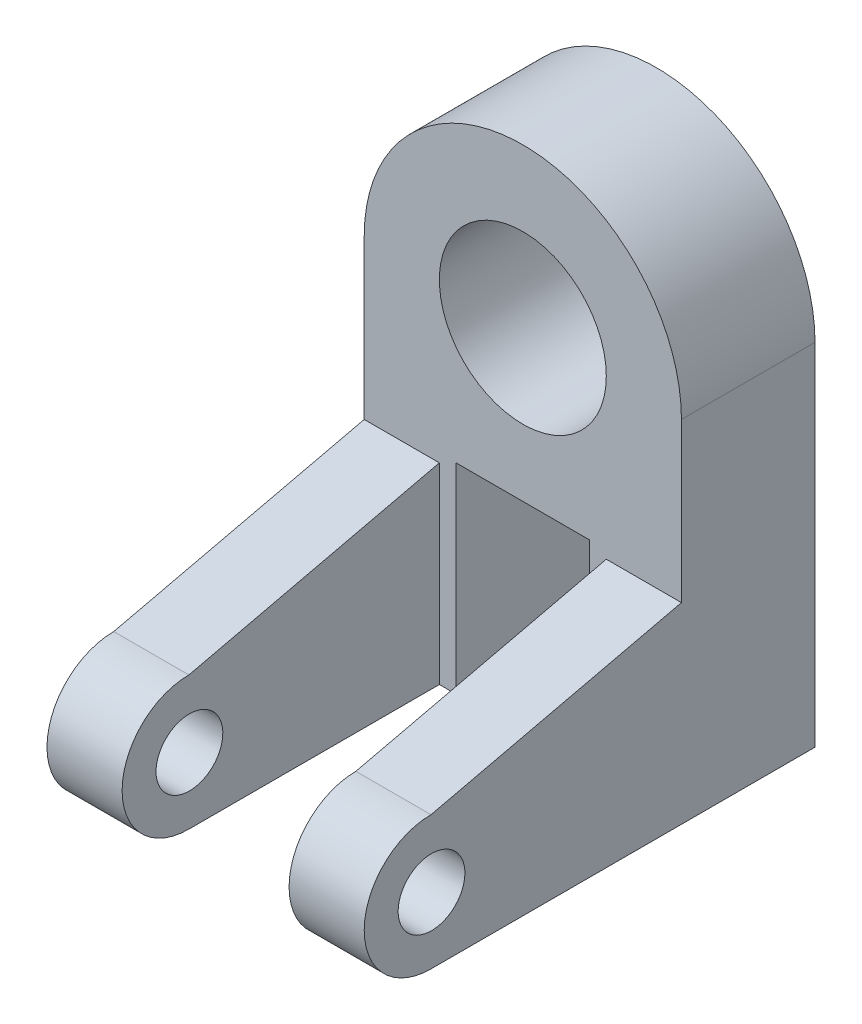
ISO-10303-21;
HEADER;
FILE_DESCRIPTION(('STEP AP214'),'2;1');
FILE_NAME('part.step','',(''),(''),'','','');
FILE_SCHEMA(('AUTOMOTIVE_DESIGN { 1 0 10303 214 1 1 1 1 }'));
ENDSEC;
DATA;
#1=APPLICATION_CONTEXT('core data for automotive mechanical design processes');
#2=APPLICATION_PROTOCOL_DEFINITION('international standard','automotive_design',2000,#1);
#3=PRODUCT_CONTEXT('',#1,'mechanical');
#4=PRODUCT('Part','Part','',(#3));
#5=PRODUCT_RELATED_PRODUCT_CATEGORY('part','',(#4));
#6=PRODUCT_DEFINITION_FORMATION('','',#4);
#7=PRODUCT_DEFINITION_CONTEXT('part definition',#1,'design');
#8=PRODUCT_DEFINITION('design','',#6,#7);
#9=PRODUCT_DEFINITION_SHAPE('','',#8);
#10=(LENGTH_UNIT() NAMED_UNIT(*) SI_UNIT(.MILLI.,.METRE.));
#11=(NAMED_UNIT(*) PLANE_ANGLE_UNIT() SI_UNIT($,.RADIAN.));
#12=(NAMED_UNIT(*) SI_UNIT($,.STERADIAN.) SOLID_ANGLE_UNIT());
#13=UNCERTAINTY_MEASURE_WITH_UNIT(LENGTH_MEASURE(1.E-05),#10,'distance_accuracy_value','');
#14=(GEOMETRIC_REPRESENTATION_CONTEXT(3) GLOBAL_UNCERTAINTY_ASSIGNED_CONTEXT((#13)) GLOBAL_UNIT_ASSIGNED_CONTEXT((#10,
#11,#12)) REPRESENTATION_CONTEXT('',''));
#15=CARTESIAN_POINT('',(0.,0.,0.));
#16=DIRECTION('',(0.,0.,1.));
#17=DIRECTION('',(1.,0.,0.));
#18=AXIS2_PLACEMENT_3D('',#15,#16,#17);
#19=CARTESIAN_POINT('',(0.,0.,32.));
#20=DIRECTION('',(0.,0.,1.));
#21=DIRECTION('',(1.,0.,0.));
#22=AXIS2_PLACEMENT_3D('',#19,#20,#21);
#23=PLANE('',#22);
#24=CARTESIAN_POINT('',(0.,0.,32.));
#25=DIRECTION('',(0.,0.,1.));
#26=DIRECTION('',(1.,0.,0.));
#27=AXIS2_PLACEMENT_3D('',#24,#25,#26);
#28=CIRCLE('',#27,20.);
#29=CARTESIAN_POINT('',(20.,0.,32.));
#30=VERTEX_POINT('',#29);
#31=EDGE_CURVE('E190',#30,#30,#28,.T.);
#32=ORIENTED_EDGE('',*,*,#31,.F.);
#33=EDGE_LOOP('',(#32));
#34=FACE_BOUND('',#33,.T.);
#35=DIRECTION('',(0.,-1.,0.));
#36=VECTOR('',#35,1.);
#37=CARTESIAN_POINT('',(20.,-84.,32.));
#38=LINE('',#37,#36);
#39=CARTESIAN_POINT('',(20.,-38.,32.));
#40=VERTEX_POINT('',#39);
#41=CARTESIAN_POINT('',(20.,-84.,32.));
#42=VERTEX_POINT('',#41);
#43=EDGE_CURVE('E50',#40,#42,#38,.T.);
#44=ORIENTED_EDGE('',*,*,#43,.F.);
#45=DIRECTION('',(1.,0.,0.));
#46=VECTOR('',#45,1.);
#47=CARTESIAN_POINT('',(20.,-38.,32.));
#48=LINE('',#47,#46);
#49=CARTESIAN_POINT('',(38.,-38.,32.));
#50=VERTEX_POINT('',#49);
#51=EDGE_CURVE('E155',#40,#50,#48,.T.);
#52=ORIENTED_EDGE('',*,*,#51,.T.);
#53=DIRECTION('',(0.,1.,0.));
#54=VECTOR('',#53,1.);
#55=CARTESIAN_POINT('',(38.,0.,32.));
#56=LINE('',#55,#54);
#57=CARTESIAN_POINT('',(38.,0.,32.));
#58=VERTEX_POINT('',#57);
#59=EDGE_CURVE('E243',#50,#58,#56,.T.);
#60=ORIENTED_EDGE('',*,*,#59,.T.);
#61=CARTESIAN_POINT('',(0.,0.,32.));
#62=DIRECTION('',(0.,0.,1.));
#63=DIRECTION('',(1.,0.,0.));
#64=AXIS2_PLACEMENT_3D('',#61,#62,#63);
#65=CIRCLE('',#64,38.);
#66=CARTESIAN_POINT('',(-38.,0.,32.));
#67=VERTEX_POINT('',#66);
#68=EDGE_CURVE('E214',#58,#67,#65,.T.);
#69=ORIENTED_EDGE('',*,*,#68,.T.);
#70=DIRECTION('',(0.,-1.,0.));
#71=VECTOR('',#70,1.);
#72=CARTESIAN_POINT('',(-38.,0.,32.));
#73=LINE('',#72,#71);
#74=CARTESIAN_POINT('',(-38.,-38.,32.));
#75=VERTEX_POINT('',#74);
#76=EDGE_CURVE('E217',#67,#75,#73,.T.);
#77=ORIENTED_EDGE('',*,*,#76,.T.);
#78=DIRECTION('',(-1.,0.,0.));
#79=VECTOR('',#78,1.);
#80=CARTESIAN_POINT('',(-20.,-38.,32.));
#81=LINE('',#80,#79);
#82=CARTESIAN_POINT('',(-20.,-38.,32.));
#83=VERTEX_POINT('',#82);
#84=EDGE_CURVE('E188',#83,#75,#81,.T.);
#85=ORIENTED_EDGE('',*,*,#84,.F.);
#86=DIRECTION('',(0.,-1.,0.));
#87=VECTOR('',#86,1.);
#88=CARTESIAN_POINT('',(-20.,-84.,32.));
#89=LINE('',#88,#87);
#90=CARTESIAN_POINT('',(-20.,-84.,32.));
#91=VERTEX_POINT('',#90);
#92=EDGE_CURVE('E175',#83,#91,#89,.T.);
#93=ORIENTED_EDGE('',*,*,#92,.T.);
#94=DIRECTION('',(1.,0.,0.));
#95=VECTOR('',#94,1.);
#96=CARTESIAN_POINT('',(-38.,-84.,32.));
#97=LINE('',#96,#95);
#98=CARTESIAN_POINT('',(-16.,-84.,32.));
#99=VERTEX_POINT('',#98);
#100=EDGE_CURVE('E181',#91,#99,#97,.T.);
#101=ORIENTED_EDGE('',*,*,#100,.T.);
#102=DIRECTION('',(0.,1.,0.));
#103=VECTOR('',#102,1.);
#104=CARTESIAN_POINT('',(-16.,-84.,32.));
#105=LINE('',#104,#103);
#106=CARTESIAN_POINT('',(-16.,-36.,32.));
#107=VERTEX_POINT('',#106);
#108=EDGE_CURVE('E264',#99,#107,#105,.T.);
#109=ORIENTED_EDGE('',*,*,#108,.T.);
#110=DIRECTION('',(1.,0.,0.));
#111=VECTOR('',#110,1.);
#112=CARTESIAN_POINT('',(-16.,-36.,32.));
#113=LINE('',#112,#111);
#114=CARTESIAN_POINT('',(16.,-36.,32.));
#115=VERTEX_POINT('',#114);
#116=EDGE_CURVE('E263',#107,#115,#113,.T.);
#117=ORIENTED_EDGE('',*,*,#116,.T.);
#118=DIRECTION('',(0.,-1.,0.));
#119=VECTOR('',#118,1.);
#120=CARTESIAN_POINT('',(16.,-84.,32.));
#121=LINE('',#120,#119);
#122=CARTESIAN_POINT('',(16.,-84.,32.));
#123=VERTEX_POINT('',#122);
#124=EDGE_CURVE('E261',#115,#123,#121,.T.);
#125=ORIENTED_EDGE('',*,*,#124,.T.);
#126=DIRECTION('',(1.,0.,0.));
#127=VECTOR('',#126,1.);
#128=CARTESIAN_POINT('',(38.,-84.,32.));
#129=LINE('',#128,#127);
#130=EDGE_CURVE('E55',#123,#42,#129,.T.);
#131=ORIENTED_EDGE('',*,*,#130,.T.);
#132=EDGE_LOOP('',(#44,#52,#60,#69,#77,#85,#93,#101,#109,#117,#125,#131));
#133=FACE_BOUND('',#132,.T.);
#134=ADVANCED_FACE('F33',(#34,#133),#23,.T.);
#135=CARTESIAN_POINT('',(0.,0.,32.));
#136=DIRECTION('',(0.,0.,-1.));
#137=DIRECTION('',(-1.,0.,0.));
#138=AXIS2_PLACEMENT_3D('',#135,#136,#137);
#139=CYLINDRICAL_SURFACE('',#138,38.);
#140=CARTESIAN_POINT('',(0.,0.,0.));
#141=DIRECTION('',(0.,0.,1.));
#142=DIRECTION('',(1.,0.,0.));
#143=AXIS2_PLACEMENT_3D('',#140,#141,#142);
#144=CIRCLE('',#143,38.);
#145=CARTESIAN_POINT('',(38.,0.,0.));
#146=VERTEX_POINT('',#145);
#147=CARTESIAN_POINT('',(-38.,0.,0.));
#148=VERTEX_POINT('',#147);
#149=EDGE_CURVE('E211',#146,#148,#144,.T.);
#150=ORIENTED_EDGE('',*,*,#149,.T.);
#151=DIRECTION('',(0.,0.,-1.));
#152=VECTOR('',#151,1.);
#153=CARTESIAN_POINT('',(-38.,0.,32.));
#154=LINE('',#153,#152);
#155=EDGE_CURVE('E11',#67,#148,#154,.T.);
#156=ORIENTED_EDGE('',*,*,#155,.F.);
#157=ORIENTED_EDGE('',*,*,#68,.F.);
#158=DIRECTION('',(0.,0.,-1.));
#159=VECTOR('',#158,1.);
#160=CARTESIAN_POINT('',(38.,0.,32.));
#161=LINE('',#160,#159);
#162=EDGE_CURVE('E240',#58,#146,#161,.T.);
#163=ORIENTED_EDGE('',*,*,#162,.T.);
#164=EDGE_LOOP('',(#150,#156,#157,#163));
#165=FACE_BOUND('',#164,.T.);
#166=ADVANCED_FACE('F35',(#165),#139,.T.);
#167=CARTESIAN_POINT('',(-38.,0.,32.));
#168=DIRECTION('',(1.,0.,0.));
#169=DIRECTION('',(0.,1.,0.));
#170=AXIS2_PLACEMENT_3D('',#167,#168,#169);
#171=PLANE('',#170);
#172=CARTESIAN_POINT('',(-38.,-68.1360490104087,91.8773499463514));
#173=DIRECTION('',(-1.,0.,0.));
#174=DIRECTION('',(0.,0.,1.));
#175=AXIS2_PLACEMENT_3D('',#172,#173,#174);
#176=CIRCLE('',#175,7.99999999999999);
#177=CARTESIAN_POINT('',(-38.,-68.1360490104087,99.8773499463514));
#178=VERTEX_POINT('',#177);
#179=EDGE_CURVE('E356',#178,#178,#176,.T.);
#180=ORIENTED_EDGE('',*,*,#179,.F.);
#181=EDGE_LOOP('',(#180));
#182=FACE_BOUND('',#181,.T.);
#183=DIRECTION('',(0.,-1.,0.));
#184=VECTOR('',#183,1.);
#185=CARTESIAN_POINT('',(-38.,0.,0.));
#186=LINE('',#185,#184);
#187=CARTESIAN_POINT('',(-38.,-84.,0.));
#188=VERTEX_POINT('',#187);
#189=EDGE_CURVE('E255',#148,#188,#186,.T.);
#190=ORIENTED_EDGE('',*,*,#189,.T.);
#191=DIRECTION('',(0.,0.,-1.));
#192=VECTOR('',#191,1.);
#193=CARTESIAN_POINT('',(-38.,-84.,32.));
#194=LINE('',#193,#192);
#195=CARTESIAN_POINT('',(-38.,-84.,92.));
#196=VERTEX_POINT('',#195);
#197=EDGE_CURVE('E42',#196,#188,#194,.T.);
#198=ORIENTED_EDGE('',*,*,#197,.F.);
#199=CARTESIAN_POINT('',(-38.,-68.,92.));
#200=DIRECTION('',(-1.,0.,0.));
#201=DIRECTION('',(0.,-1.,0.));
#202=AXIS2_PLACEMENT_3D('',#199,#200,#201);
#203=CIRCLE('',#202,16.);
#204=CARTESIAN_POINT('',(-38.,-52.,92.));
#205=VERTEX_POINT('',#204);
#206=EDGE_CURVE('E167',#196,#205,#203,.T.);
#207=ORIENTED_EDGE('',*,*,#206,.T.);
#208=DIRECTION('',(0.,0.227229615606419,-0.973841209741793));
#209=VECTOR('',#208,1.);
#210=CARTESIAN_POINT('',(-38.,-52.,92.));
#211=LINE('',#210,#209);
#212=EDGE_CURVE('E180',#205,#75,#211,.T.);
#213=ORIENTED_EDGE('',*,*,#212,.T.);
#214=ORIENTED_EDGE('',*,*,#76,.F.);
#215=ORIENTED_EDGE('',*,*,#155,.T.);
#216=EDGE_LOOP('',(#190,#198,#207,#213,#214,#215));
#217=FACE_BOUND('',#216,.T.);
#218=ADVANCED_FACE('F297',(#182,#217),#171,.F.);
#219=CARTESIAN_POINT('',(-38.,-84.,32.));
#220=DIRECTION('',(0.,1.,0.));
#221=DIRECTION('',(0.,0.,1.));
#222=AXIS2_PLACEMENT_3D('',#219,#220,#221);
#223=PLANE('',#222);
#224=DIRECTION('',(1.,0.,0.));
#225=VECTOR('',#224,1.);
#226=CARTESIAN_POINT('',(-38.,-84.,0.));
#227=LINE('',#226,#225);
#228=CARTESIAN_POINT('',(-16.,-84.,0.));
#229=VERTEX_POINT('',#228);
#230=EDGE_CURVE('E253',#188,#229,#227,.T.);
#231=ORIENTED_EDGE('',*,*,#230,.T.);
#232=DIRECTION('',(0.,0.,-1.));
#233=VECTOR('',#232,1.);
#234=CARTESIAN_POINT('',(-16.,-84.,32.));
#235=LINE('',#234,#233);
#236=EDGE_CURVE('E225',#99,#229,#235,.T.);
#237=ORIENTED_EDGE('',*,*,#236,.F.);
#238=ORIENTED_EDGE('',*,*,#100,.F.);
#239=DIRECTION('',(0.,0.,1.));
#240=VECTOR('',#239,1.);
#241=CARTESIAN_POINT('',(-20.,-84.,32.));
#242=LINE('',#241,#240);
#243=CARTESIAN_POINT('',(-20.,-84.,92.));
#244=VERTEX_POINT('',#243);
#245=EDGE_CURVE('E179',#91,#244,#242,.T.);
#246=ORIENTED_EDGE('',*,*,#245,.T.);
#247=DIRECTION('',(-1.,0.,0.));
#248=VECTOR('',#247,1.);
#249=CARTESIAN_POINT('',(-20.,-84.,92.));
#250=LINE('',#249,#248);
#251=EDGE_CURVE('E205',#244,#196,#250,.T.);
#252=ORIENTED_EDGE('',*,*,#251,.T.);
#253=ORIENTED_EDGE('',*,*,#197,.T.);
#254=EDGE_LOOP('',(#231,#237,#238,#246,#252,#253));
#255=FACE_BOUND('',#254,.T.);
#256=ADVANCED_FACE('F271',(#255),#223,.F.);
#257=CARTESIAN_POINT('',(-16.,-84.,32.));
#258=DIRECTION('',(-1.,0.,0.));
#259=DIRECTION('',(0.,-1.,0.));
#260=AXIS2_PLACEMENT_3D('',#257,#258,#259);
#261=PLANE('',#260);
#262=DIRECTION('',(0.,1.,0.));
#263=VECTOR('',#262,1.);
#264=CARTESIAN_POINT('',(-16.,-84.,0.));
#265=LINE('',#264,#263);
#266=CARTESIAN_POINT('',(-16.,-36.,0.));
#267=VERTEX_POINT('',#266);
#268=EDGE_CURVE('E251',#229,#267,#265,.T.);
#269=ORIENTED_EDGE('',*,*,#268,.T.);
#270=DIRECTION('',(0.,0.,-1.));
#271=VECTOR('',#270,1.);
#272=CARTESIAN_POINT('',(-16.,-36.,32.));
#273=LINE('',#272,#271);
#274=EDGE_CURVE('E228',#107,#267,#273,.T.);
#275=ORIENTED_EDGE('',*,*,#274,.F.);
#276=ORIENTED_EDGE('',*,*,#108,.F.);
#277=ORIENTED_EDGE('',*,*,#236,.T.);
#278=EDGE_LOOP('',(#269,#275,#276,#277));
#279=FACE_BOUND('',#278,.T.);
#280=ADVANCED_FACE('F275',(#279),#261,.F.);
#281=CARTESIAN_POINT('',(-16.,-36.,32.));
#282=DIRECTION('',(0.,1.,0.));
#283=DIRECTION('',(0.,0.,1.));
#284=AXIS2_PLACEMENT_3D('',#281,#282,#283);
#285=PLANE('',#284);
#286=DIRECTION('',(1.,0.,0.));
#287=VECTOR('',#286,1.);
#288=CARTESIAN_POINT('',(-16.,-36.,0.));
#289=LINE('',#288,#287);
#290=CARTESIAN_POINT('',(16.,-36.,0.));
#291=VERTEX_POINT('',#290);
#292=EDGE_CURVE('E249',#267,#291,#289,.T.);
#293=ORIENTED_EDGE('',*,*,#292,.T.);
#294=DIRECTION('',(0.,0.,-1.));
#295=VECTOR('',#294,1.);
#296=CARTESIAN_POINT('',(16.,-36.,32.));
#297=LINE('',#296,#295);
#298=EDGE_CURVE('E231',#115,#291,#297,.T.);
#299=ORIENTED_EDGE('',*,*,#298,.F.);
#300=ORIENTED_EDGE('',*,*,#116,.F.);
#301=ORIENTED_EDGE('',*,*,#274,.T.);
#302=EDGE_LOOP('',(#293,#299,#300,#301));
#303=FACE_BOUND('',#302,.T.);
#304=ADVANCED_FACE('F280',(#303),#285,.F.);
#305=CARTESIAN_POINT('',(16.,-84.,32.));
#306=DIRECTION('',(1.,0.,0.));
#307=DIRECTION('',(0.,1.,0.));
#308=AXIS2_PLACEMENT_3D('',#305,#306,#307);
#309=PLANE('',#308);
#310=DIRECTION('',(0.,-1.,0.));
#311=VECTOR('',#310,1.);
#312=CARTESIAN_POINT('',(16.,-84.,0.));
#313=LINE('',#312,#311);
#314=CARTESIAN_POINT('',(16.,-84.,0.));
#315=VERTEX_POINT('',#314);
#316=EDGE_CURVE('E247',#291,#315,#313,.T.);
#317=ORIENTED_EDGE('',*,*,#316,.T.);
#318=DIRECTION('',(0.,0.,-1.));
#319=VECTOR('',#318,1.);
#320=CARTESIAN_POINT('',(16.,-84.,32.));
#321=LINE('',#320,#319);
#322=EDGE_CURVE('E234',#123,#315,#321,.T.);
#323=ORIENTED_EDGE('',*,*,#322,.F.);
#324=ORIENTED_EDGE('',*,*,#124,.F.);
#325=ORIENTED_EDGE('',*,*,#298,.T.);
#326=EDGE_LOOP('',(#317,#323,#324,#325));
#327=FACE_BOUND('',#326,.T.);
#328=ADVANCED_FACE('F284',(#327),#309,.F.);
#329=CARTESIAN_POINT('',(38.,-84.,32.));
#330=DIRECTION('',(0.,1.,0.));
#331=DIRECTION('',(0.,0.,1.));
#332=AXIS2_PLACEMENT_3D('',#329,#330,#331);
#333=PLANE('',#332);
#334=DIRECTION('',(1.,0.,0.));
#335=VECTOR('',#334,1.);
#336=CARTESIAN_POINT('',(38.,-84.,0.));
#337=LINE('',#336,#335);
#338=CARTESIAN_POINT('',(38.,-84.,0.));
#339=VERTEX_POINT('',#338);
#340=EDGE_CURVE('E245',#315,#339,#337,.T.);
#341=ORIENTED_EDGE('',*,*,#340,.T.);
#342=DIRECTION('',(0.,0.,-1.));
#343=VECTOR('',#342,1.);
#344=CARTESIAN_POINT('',(38.,-84.,32.));
#345=LINE('',#344,#343);
#346=CARTESIAN_POINT('',(38.,-84.,92.));
#347=VERTEX_POINT('',#346);
#348=EDGE_CURVE('E237',#347,#339,#345,.T.);
#349=ORIENTED_EDGE('',*,*,#348,.F.);
#350=DIRECTION('',(1.,0.,0.));
#351=VECTOR('',#350,1.);
#352=CARTESIAN_POINT('',(20.,-84.,92.));
#353=LINE('',#352,#351);
#354=CARTESIAN_POINT('',(20.,-84.,92.));
#355=VERTEX_POINT('',#354);
#356=EDGE_CURVE('E154',#355,#347,#353,.T.);
#357=ORIENTED_EDGE('',*,*,#356,.F.);
#358=DIRECTION('',(0.,0.,1.));
#359=VECTOR('',#358,1.);
#360=CARTESIAN_POINT('',(20.,-84.,32.));
#361=LINE('',#360,#359);
#362=EDGE_CURVE('E141',#42,#355,#361,.T.);
#363=ORIENTED_EDGE('',*,*,#362,.F.);
#364=ORIENTED_EDGE('',*,*,#130,.F.);
#365=ORIENTED_EDGE('',*,*,#322,.T.);
#366=EDGE_LOOP('',(#341,#349,#357,#363,#364,#365));
#367=FACE_BOUND('',#366,.T.);
#368=ADVANCED_FACE('F288',(#367),#333,.F.);
#369=CARTESIAN_POINT('',(38.,0.,32.));
#370=DIRECTION('',(-1.,0.,0.));
#371=DIRECTION('',(0.,-1.,0.));
#372=AXIS2_PLACEMENT_3D('',#369,#370,#371);
#373=PLANE('',#372);
#374=CARTESIAN_POINT('',(38.,-68.1360490104087,91.8773499463514));
#375=DIRECTION('',(-1.,0.,0.));
#376=DIRECTION('',(0.,0.,1.));
#377=AXIS2_PLACEMENT_3D('',#374,#375,#376);
#378=CIRCLE('',#377,7.99999999999999);
#379=CARTESIAN_POINT('',(38.,-68.1360490104087,99.8773499463514));
#380=VERTEX_POINT('',#379);
#381=EDGE_CURVE('E350',#380,#380,#378,.T.);
#382=ORIENTED_EDGE('',*,*,#381,.T.);
#383=EDGE_LOOP('',(#382));
#384=FACE_BOUND('',#383,.T.);
#385=DIRECTION('',(0.,1.,0.));
#386=VECTOR('',#385,1.);
#387=CARTESIAN_POINT('',(38.,0.,0.));
#388=LINE('',#387,#386);
#389=EDGE_CURVE('E218',#339,#146,#388,.T.);
#390=ORIENTED_EDGE('',*,*,#389,.T.);
#391=ORIENTED_EDGE('',*,*,#162,.F.);
#392=ORIENTED_EDGE('',*,*,#59,.F.);
#393=DIRECTION('',(0.,0.227229615606419,-0.973841209741793));
#394=VECTOR('',#393,1.);
#395=CARTESIAN_POINT('',(38.,-52.,92.));
#396=LINE('',#395,#394);
#397=CARTESIAN_POINT('',(38.,-52.,92.));
#398=VERTEX_POINT('',#397);
#399=EDGE_CURVE('E163',#398,#50,#396,.T.);
#400=ORIENTED_EDGE('',*,*,#399,.F.);
#401=CARTESIAN_POINT('',(38.,-68.,92.));
#402=DIRECTION('',(-1.,0.,0.));
#403=DIRECTION('',(0.,-1.,0.));
#404=AXIS2_PLACEMENT_3D('',#401,#402,#403);
#405=CIRCLE('',#404,16.);
#406=EDGE_CURVE('E150',#347,#398,#405,.T.);
#407=ORIENTED_EDGE('',*,*,#406,.F.);
#408=ORIENTED_EDGE('',*,*,#348,.T.);
#409=EDGE_LOOP('',(#390,#391,#392,#400,#407,#408));
#410=FACE_BOUND('',#409,.T.);
#411=ADVANCED_FACE('F290',(#384,#410),#373,.F.);
#412=CARTESIAN_POINT('',(0.,0.,0.));
#413=DIRECTION('',(0.,0.,1.));
#414=DIRECTION('',(1.,0.,0.));
#415=AXIS2_PLACEMENT_3D('',#412,#413,#414);
#416=PLANE('',#415);
#417=CARTESIAN_POINT('',(0.,0.,0.));
#418=DIRECTION('',(0.,0.,1.));
#419=DIRECTION('',(1.,0.,0.));
#420=AXIS2_PLACEMENT_3D('',#417,#418,#419);
#421=CIRCLE('',#420,20.);
#422=CARTESIAN_POINT('',(20.,0.,0.));
#423=VERTEX_POINT('',#422);
#424=EDGE_CURVE('E208',#423,#423,#421,.T.);
#425=ORIENTED_EDGE('',*,*,#424,.T.);
#426=EDGE_LOOP('',(#425));
#427=FACE_BOUND('',#426,.T.);
#428=ORIENTED_EDGE('',*,*,#149,.F.);
#429=ORIENTED_EDGE('',*,*,#389,.F.);
#430=ORIENTED_EDGE('',*,*,#340,.F.);
#431=ORIENTED_EDGE('',*,*,#316,.F.);
#432=ORIENTED_EDGE('',*,*,#292,.F.);
#433=ORIENTED_EDGE('',*,*,#268,.F.);
#434=ORIENTED_EDGE('',*,*,#230,.F.);
#435=ORIENTED_EDGE('',*,*,#189,.F.);
#436=EDGE_LOOP('',(#428,#429,#430,#431,#432,#433,#434,#435));
#437=FACE_BOUND('',#436,.T.);
#438=ADVANCED_FACE('F299',(#427,#437),#416,.F.);
#439=CARTESIAN_POINT('',(0.,0.,0.));
#440=DIRECTION('',(0.,0.,1.));
#441=DIRECTION('',(1.,0.,0.));
#442=AXIS2_PLACEMENT_3D('',#439,#440,#441);
#443=CYLINDRICAL_SURFACE('',#442,20.);
#444=ORIENTED_EDGE('',*,*,#424,.F.);
#445=EDGE_LOOP('',(#444));
#446=FACE_BOUND('',#445,.T.);
#447=ORIENTED_EDGE('',*,*,#31,.T.);
#448=EDGE_LOOP('',(#447));
#449=FACE_BOUND('',#448,.T.);
#450=ADVANCED_FACE('F301',(#446,#449),#443,.F.);
#451=CARTESIAN_POINT('',(-20.,-52.,92.));
#452=DIRECTION('',(0.,0.973841209741793,0.227229615606419));
#453=DIRECTION('',(0.,-0.227229615606419,0.973841209741793));
#454=AXIS2_PLACEMENT_3D('',#451,#452,#453);
#455=PLANE('',#454);
#456=ORIENTED_EDGE('',*,*,#212,.F.);
#457=DIRECTION('',(-1.,0.,0.));
#458=VECTOR('',#457,1.);
#459=CARTESIAN_POINT('',(-20.,-52.,92.));
#460=LINE('',#459,#458);
#461=CARTESIAN_POINT('',(-20.,-52.,92.));
#462=VERTEX_POINT('',#461);
#463=EDGE_CURVE('E191',#462,#205,#460,.T.);
#464=ORIENTED_EDGE('',*,*,#463,.F.);
#465=DIRECTION('',(0.,0.227229615606419,-0.973841209741793));
#466=VECTOR('',#465,1.);
#467=CARTESIAN_POINT('',(-20.,-52.,92.));
#468=LINE('',#467,#466);
#469=EDGE_CURVE('E203',#462,#83,#468,.T.);
#470=ORIENTED_EDGE('',*,*,#469,.T.);
#471=ORIENTED_EDGE('',*,*,#84,.T.);
#472=EDGE_LOOP('',(#456,#464,#470,#471));
#473=FACE_BOUND('',#472,.T.);
#474=ADVANCED_FACE('F308',(#473),#455,.T.);
#475=CARTESIAN_POINT('',(-20.,-68.,92.));
#476=DIRECTION('',(-1.,0.,0.));
#477=DIRECTION('',(0.,-1.,0.));
#478=AXIS2_PLACEMENT_3D('',#475,#476,#477);
#479=CYLINDRICAL_SURFACE('',#478,16.);
#480=ORIENTED_EDGE('',*,*,#206,.F.);
#481=ORIENTED_EDGE('',*,*,#251,.F.);
#482=CARTESIAN_POINT('',(-20.,-68.,92.));
#483=DIRECTION('',(-1.,0.,0.));
#484=DIRECTION('',(0.,-1.,0.));
#485=AXIS2_PLACEMENT_3D('',#482,#483,#484);
#486=CIRCLE('',#485,16.);
#487=EDGE_CURVE('E172',#244,#462,#486,.T.);
#488=ORIENTED_EDGE('',*,*,#487,.T.);
#489=ORIENTED_EDGE('',*,*,#463,.T.);
#490=EDGE_LOOP('',(#480,#481,#488,#489));
#491=FACE_BOUND('',#490,.T.);
#492=ADVANCED_FACE('F321',(#491),#479,.T.);
#493=CARTESIAN_POINT('',(-20.,-68.,92.));
#494=DIRECTION('',(-1.,0.,0.));
#495=DIRECTION('',(0.,-1.,0.));
#496=AXIS2_PLACEMENT_3D('',#493,#494,#495);
#497=PLANE('',#496);
#498=CARTESIAN_POINT('',(-20.,-68.1360490104087,91.8773499463514));
#499=DIRECTION('',(-1.,0.,0.));
#500=DIRECTION('',(0.,-1.,0.));
#501=AXIS2_PLACEMENT_3D('',#498,#499,#500);
#502=CIRCLE('',#501,7.99999999999999);
#503=CARTESIAN_POINT('',(-20.,-76.1360490104087,91.8773499463514));
#504=VERTEX_POINT('',#503);
#505=EDGE_CURVE('E37',#504,#504,#502,.T.);
#506=ORIENTED_EDGE('',*,*,#505,.T.);
#507=EDGE_LOOP('',(#506));
#508=FACE_BOUND('',#507,.T.);
#509=ORIENTED_EDGE('',*,*,#92,.F.);
#510=ORIENTED_EDGE('',*,*,#469,.F.);
#511=ORIENTED_EDGE('',*,*,#487,.F.);
#512=ORIENTED_EDGE('',*,*,#245,.F.);
#513=EDGE_LOOP('',(#509,#510,#511,#512));
#514=FACE_BOUND('',#513,.T.);
#515=ADVANCED_FACE('F324',(#508,#514),#497,.F.);
#516=CARTESIAN_POINT('',(20.,-68.,92.));
#517=DIRECTION('',(1.,0.,0.));
#518=DIRECTION('',(0.,1.,0.));
#519=AXIS2_PLACEMENT_3D('',#516,#517,#518);
#520=CYLINDRICAL_SURFACE('',#519,16.);
#521=ORIENTED_EDGE('',*,*,#406,.T.);
#522=DIRECTION('',(1.,0.,0.));
#523=VECTOR('',#522,1.);
#524=CARTESIAN_POINT('',(20.,-52.,92.));
#525=LINE('',#524,#523);
#526=CARTESIAN_POINT('',(20.,-52.,92.));
#527=VERTEX_POINT('',#526);
#528=EDGE_CURVE('E147',#527,#398,#525,.T.);
#529=ORIENTED_EDGE('',*,*,#528,.F.);
#530=CARTESIAN_POINT('',(20.,-68.,92.));
#531=DIRECTION('',(-1.,0.,0.));
#532=DIRECTION('',(0.,-1.,0.));
#533=AXIS2_PLACEMENT_3D('',#530,#531,#532);
#534=CIRCLE('',#533,16.);
#535=EDGE_CURVE('E135',#355,#527,#534,.T.);
#536=ORIENTED_EDGE('',*,*,#535,.F.);
#537=ORIENTED_EDGE('',*,*,#356,.T.);
#538=EDGE_LOOP('',(#521,#529,#536,#537));
#539=FACE_BOUND('',#538,.T.);
#540=ADVANCED_FACE('F148',(#539),#520,.T.);
#541=CARTESIAN_POINT('',(20.,-52.,92.));
#542=DIRECTION('',(0.,-0.973841209741793,-0.227229615606419));
#543=DIRECTION('',(0.,0.227229615606419,-0.973841209741793));
#544=AXIS2_PLACEMENT_3D('',#541,#542,#543);
#545=PLANE('',#544);
#546=ORIENTED_EDGE('',*,*,#399,.T.);
#547=ORIENTED_EDGE('',*,*,#51,.F.);
#548=DIRECTION('',(0.,0.227229615606419,-0.973841209741793));
#549=VECTOR('',#548,1.);
#550=CARTESIAN_POINT('',(20.,-52.,92.));
#551=LINE('',#550,#549);
#552=EDGE_CURVE('E139',#527,#40,#551,.T.);
#553=ORIENTED_EDGE('',*,*,#552,.F.);
#554=ORIENTED_EDGE('',*,*,#528,.T.);
#555=EDGE_LOOP('',(#546,#547,#553,#554));
#556=FACE_BOUND('',#555,.T.);
#557=ADVANCED_FACE('F157',(#556),#545,.F.);
#558=CARTESIAN_POINT('',(20.,-68.,92.));
#559=DIRECTION('',(1.,0.,0.));
#560=DIRECTION('',(0.,-1.,0.));
#561=AXIS2_PLACEMENT_3D('',#558,#559,#560);
#562=PLANE('',#561);
#563=CARTESIAN_POINT('',(20.,-68.1360490104087,91.8773499463514));
#564=DIRECTION('',(1.,0.,0.));
#565=DIRECTION('',(0.,1.,0.));
#566=AXIS2_PLACEMENT_3D('',#563,#564,#565);
#567=CIRCLE('',#566,7.99999999999999);
#568=CARTESIAN_POINT('',(20.,-60.1360490104087,91.8773499463514));
#569=VERTEX_POINT('',#568);
#570=EDGE_CURVE('E165',#569,#569,#567,.T.);
#571=ORIENTED_EDGE('',*,*,#570,.T.);
#572=EDGE_LOOP('',(#571));
#573=FACE_BOUND('',#572,.T.);
#574=ORIENTED_EDGE('',*,*,#43,.T.);
#575=ORIENTED_EDGE('',*,*,#362,.T.);
#576=ORIENTED_EDGE('',*,*,#535,.T.);
#577=ORIENTED_EDGE('',*,*,#552,.T.);
#578=EDGE_LOOP('',(#574,#575,#576,#577));
#579=FACE_BOUND('',#578,.T.);
#580=ADVANCED_FACE('F137',(#573,#579),#562,.F.);
#581=CARTESIAN_POINT('',(-38.,-68.1360490104087,91.8773499463514));
#582=DIRECTION('',(-1.,0.,0.));
#583=DIRECTION('',(0.,0.,1.));
#584=AXIS2_PLACEMENT_3D('',#581,#582,#583);
#585=CYLINDRICAL_SURFACE('',#584,7.99999999999999);
#586=ORIENTED_EDGE('',*,*,#179,.T.);
#587=EDGE_LOOP('',(#586));
#588=FACE_BOUND('',#587,.T.);
#589=ORIENTED_EDGE('',*,*,#505,.F.);
#590=EDGE_LOOP('',(#589));
#591=FACE_BOUND('',#590,.T.);
#592=ADVANCED_FACE('F338',(#588,#591),#585,.F.);
#593=ORIENTED_EDGE('',*,*,#381,.F.);
#594=EDGE_LOOP('',(#593));
#595=FACE_BOUND('',#594,.T.);
#596=ORIENTED_EDGE('',*,*,#570,.F.);
#597=EDGE_LOOP('',(#596));
#598=FACE_BOUND('',#597,.T.);
#599=ADVANCED_FACE('F340',(#595,#598),#585,.F.);
#600=CLOSED_SHELL('',(#134,#166,#218,#256,#280,#304,#328,#368,#411,#438,#450,#474,#492,#515,
#540,#557,#580,#592,#599));
#601=MANIFOLD_SOLID_BREP('B2',#600);
#602=ADVANCED_BREP_SHAPE_REPRESENTATION('',(#18,#601),#14);
#603=SHAPE_DEFINITION_REPRESENTATION(#9,#602);
ENDSEC;
END-ISO-10303-21;
